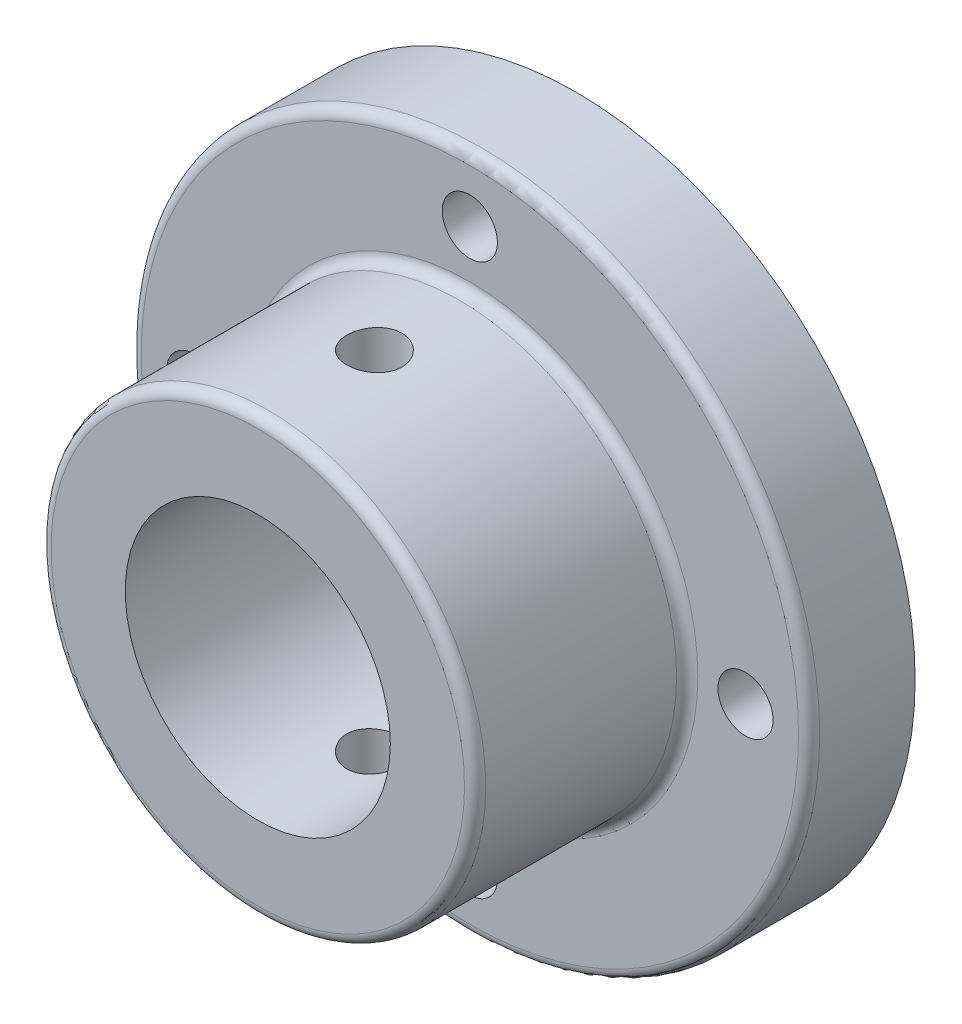
ISO-10303-21;
HEADER;
FILE_DESCRIPTION(('STEP AP214'),'2;1');
FILE_NAME('part.step','',(''),(''),'','','');
FILE_SCHEMA(('AUTOMOTIVE_DESIGN { 1 0 10303 214 1 1 1 1 }'));
ENDSEC;
DATA;
#1=APPLICATION_CONTEXT('core data for automotive mechanical design processes');
#2=APPLICATION_PROTOCOL_DEFINITION('international standard','automotive_design',2000,#1);
#3=PRODUCT_CONTEXT('',#1,'mechanical');
#4=PRODUCT('Part','Part','',(#3));
#5=PRODUCT_RELATED_PRODUCT_CATEGORY('part','',(#4));
#6=PRODUCT_DEFINITION_FORMATION('','',#4);
#7=PRODUCT_DEFINITION_CONTEXT('part definition',#1,'design');
#8=PRODUCT_DEFINITION('design','',#6,#7);
#9=PRODUCT_DEFINITION_SHAPE('','',#8);
#10=(LENGTH_UNIT() NAMED_UNIT(*) SI_UNIT(.MILLI.,.METRE.));
#11=(NAMED_UNIT(*) PLANE_ANGLE_UNIT() SI_UNIT($,.RADIAN.));
#12=(NAMED_UNIT(*) SI_UNIT($,.STERADIAN.) SOLID_ANGLE_UNIT());
#13=UNCERTAINTY_MEASURE_WITH_UNIT(LENGTH_MEASURE(1.E-05),#10,'distance_accuracy_value','');
#14=(GEOMETRIC_REPRESENTATION_CONTEXT(3) GLOBAL_UNCERTAINTY_ASSIGNED_CONTEXT((#13)) GLOBAL_UNIT_ASSIGNED_CONTEXT((#10,
#11,#12)) REPRESENTATION_CONTEXT('',''));
#15=CARTESIAN_POINT('',(0.,0.,0.));
#16=DIRECTION('',(0.,0.,1.));
#17=DIRECTION('',(1.,0.,0.));
#18=AXIS2_PLACEMENT_3D('',#15,#16,#17);
#19=CARTESIAN_POINT('',(0.,0.,5.));
#20=DIRECTION('',(0.,0.,1.));
#21=DIRECTION('',(1.,0.,0.));
#22=AXIS2_PLACEMENT_3D('',#19,#20,#21);
#23=PLANE('',#22);
#24=CARTESIAN_POINT('',(0.,0.,5.));
#25=DIRECTION('',(0.,0.,1.));
#26=DIRECTION('',(1.,0.,0.));
#27=AXIS2_PLACEMENT_3D('',#24,#25,#26);
#28=CIRCLE('',#27,15.5);
#29=CARTESIAN_POINT('',(15.5,0.,5.));
#30=VERTEX_POINT('',#29);
#31=EDGE_CURVE('E45',#30,#30,#28,.T.);
#32=ORIENTED_EDGE('',*,*,#31,.T.);
#33=EDGE_LOOP('',(#32));
#34=FACE_BOUND('',#33,.T.);
#35=CARTESIAN_POINT('',(0.,0.,5.));
#36=DIRECTION('',(0.,0.,1.));
#37=DIRECTION('',(1.,0.,0.));
#38=AXIS2_PLACEMENT_3D('',#35,#36,#37);
#39=CIRCLE('',#38,10.75);
#40=CARTESIAN_POINT('',(10.75,0.,5.));
#41=VERTEX_POINT('',#40);
#42=EDGE_CURVE('E49',#41,#41,#39,.F.);
#43=ORIENTED_EDGE('',*,*,#42,.T.);
#44=EDGE_LOOP('',(#43));
#45=FACE_BOUND('',#44,.T.);
#46=CARTESIAN_POINT('',(-13.,0.,5.));
#47=DIRECTION('',(0.,0.,1.));
#48=DIRECTION('',(1.,0.,0.));
#49=AXIS2_PLACEMENT_3D('',#46,#47,#48);
#50=CIRCLE('',#49,1.3);
#51=CARTESIAN_POINT('',(-11.7,0.,5.));
#52=VERTEX_POINT('',#51);
#53=EDGE_CURVE('E147',#52,#52,#50,.T.);
#54=ORIENTED_EDGE('',*,*,#53,.F.);
#55=EDGE_LOOP('',(#54));
#56=FACE_BOUND('',#55,.T.);
#57=CARTESIAN_POINT('',(13.,0.,5.));
#58=DIRECTION('',(0.,0.,1.));
#59=DIRECTION('',(1.,0.,0.));
#60=AXIS2_PLACEMENT_3D('',#57,#58,#59);
#61=CIRCLE('',#60,1.30000000000004);
#62=CARTESIAN_POINT('',(14.3,0.,5.));
#63=VERTEX_POINT('',#62);
#64=EDGE_CURVE('E151',#63,#63,#61,.T.);
#65=ORIENTED_EDGE('',*,*,#64,.F.);
#66=EDGE_LOOP('',(#65));
#67=FACE_BOUND('',#66,.T.);
#68=CARTESIAN_POINT('',(0.,13.,5.));
#69=DIRECTION('',(0.,0.,1.));
#70=DIRECTION('',(1.,0.,0.));
#71=AXIS2_PLACEMENT_3D('',#68,#69,#70);
#72=CIRCLE('',#71,1.3);
#73=CARTESIAN_POINT('',(1.3,13.,5.));
#74=VERTEX_POINT('',#73);
#75=EDGE_CURVE('E155',#74,#74,#72,.T.);
#76=ORIENTED_EDGE('',*,*,#75,.F.);
#77=EDGE_LOOP('',(#76));
#78=FACE_BOUND('',#77,.T.);
#79=CARTESIAN_POINT('',(0.,-13.,5.));
#80=DIRECTION('',(0.,0.,1.));
#81=DIRECTION('',(1.,0.,0.));
#82=AXIS2_PLACEMENT_3D('',#79,#80,#81);
#83=CIRCLE('',#82,1.3);
#84=CARTESIAN_POINT('',(1.3,-13.,5.));
#85=VERTEX_POINT('',#84);
#86=EDGE_CURVE('E158',#85,#85,#83,.T.);
#87=ORIENTED_EDGE('',*,*,#86,.F.);
#88=EDGE_LOOP('',(#87));
#89=FACE_BOUND('',#88,.T.);
#90=ADVANCED_FACE('F38',(#34,#45,#56,#67,#78,#89),#23,.T.);
#91=CARTESIAN_POINT('',(0.,0.,0.));
#92=DIRECTION('',(0.,0.,1.));
#93=DIRECTION('',(1.,0.,0.));
#94=AXIS2_PLACEMENT_3D('',#91,#92,#93);
#95=PLANE('',#94);
#96=CARTESIAN_POINT('',(0.,0.,0.));
#97=DIRECTION('',(0.,0.,1.));
#98=DIRECTION('',(1.,0.,0.));
#99=AXIS2_PLACEMENT_3D('',#96,#97,#98);
#100=CIRCLE('',#99,6.25);
#101=CARTESIAN_POINT('',(6.25,0.,0.));
#102=VERTEX_POINT('',#101);
#103=EDGE_CURVE('E171',#102,#102,#100,.T.);
#104=ORIENTED_EDGE('',*,*,#103,.T.);
#105=EDGE_LOOP('',(#104));
#106=FACE_BOUND('',#105,.T.);
#107=CARTESIAN_POINT('',(-13.,0.,0.));
#108=DIRECTION('',(0.,0.,1.));
#109=DIRECTION('',(1.,0.,0.));
#110=AXIS2_PLACEMENT_3D('',#107,#108,#109);
#111=CIRCLE('',#110,1.3);
#112=CARTESIAN_POINT('',(-11.7,0.,0.));
#113=VERTEX_POINT('',#112);
#114=EDGE_CURVE('E168',#113,#113,#111,.T.);
#115=ORIENTED_EDGE('',*,*,#114,.T.);
#116=EDGE_LOOP('',(#115));
#117=FACE_BOUND('',#116,.T.);
#118=CARTESIAN_POINT('',(0.,-13.,0.));
#119=DIRECTION('',(0.,0.,1.));
#120=DIRECTION('',(1.,0.,0.));
#121=AXIS2_PLACEMENT_3D('',#118,#119,#120);
#122=CIRCLE('',#121,1.3);
#123=CARTESIAN_POINT('',(1.3,-13.,0.));
#124=VERTEX_POINT('',#123);
#125=EDGE_CURVE('E161',#124,#124,#122,.T.);
#126=ORIENTED_EDGE('',*,*,#125,.T.);
#127=EDGE_LOOP('',(#126));
#128=FACE_BOUND('',#127,.T.);
#129=CARTESIAN_POINT('',(13.,0.,0.));
#130=DIRECTION('',(0.,0.,1.));
#131=DIRECTION('',(1.,0.,0.));
#132=AXIS2_PLACEMENT_3D('',#129,#130,#131);
#133=CIRCLE('',#132,1.30000000000004);
#134=CARTESIAN_POINT('',(14.3,0.,0.));
#135=VERTEX_POINT('',#134);
#136=EDGE_CURVE('E160',#135,#135,#133,.T.);
#137=ORIENTED_EDGE('',*,*,#136,.T.);
#138=EDGE_LOOP('',(#137));
#139=FACE_BOUND('',#138,.T.);
#140=CARTESIAN_POINT('',(0.,13.,0.));
#141=DIRECTION('',(0.,0.,1.));
#142=DIRECTION('',(1.,0.,0.));
#143=AXIS2_PLACEMENT_3D('',#140,#141,#142);
#144=CIRCLE('',#143,1.3);
#145=CARTESIAN_POINT('',(1.3,13.,0.));
#146=VERTEX_POINT('',#145);
#147=EDGE_CURVE('E175',#146,#146,#144,.T.);
#148=ORIENTED_EDGE('',*,*,#147,.T.);
#149=EDGE_LOOP('',(#148));
#150=FACE_BOUND('',#149,.T.);
#151=CARTESIAN_POINT('',(0.,0.,0.));
#152=DIRECTION('',(0.,0.,1.));
#153=DIRECTION('',(1.,0.,0.));
#154=AXIS2_PLACEMENT_3D('',#151,#152,#153);
#155=CIRCLE('',#154,16.);
#156=CARTESIAN_POINT('',(16.,0.,0.));
#157=VERTEX_POINT('',#156);
#158=EDGE_CURVE('E64',#157,#157,#155,.T.);
#159=ORIENTED_EDGE('',*,*,#158,.F.);
#160=EDGE_LOOP('',(#159));
#161=FACE_BOUND('',#160,.T.);
#162=ADVANCED_FACE('F121',(#106,#117,#128,#139,#150,#161),#95,.F.);
#163=CARTESIAN_POINT('',(0.,0.,5.));
#164=DIRECTION('',(0.,0.,-1.));
#165=DIRECTION('',(-1.,0.,0.));
#166=AXIS2_PLACEMENT_3D('',#163,#164,#165);
#167=CYLINDRICAL_SURFACE('',#166,16.);
#168=CARTESIAN_POINT('',(0.,0.,4.5));
#169=DIRECTION('',(0.,0.,1.));
#170=DIRECTION('',(1.,0.,0.));
#171=AXIS2_PLACEMENT_3D('',#168,#169,#170);
#172=CIRCLE('',#171,16.);
#173=CARTESIAN_POINT('',(16.,0.,4.5));
#174=VERTEX_POINT('',#173);
#175=EDGE_CURVE('E10',#174,#174,#172,.F.);
#176=ORIENTED_EDGE('',*,*,#175,.T.);
#177=EDGE_LOOP('',(#176));
#178=FACE_BOUND('',#177,.T.);
#179=ORIENTED_EDGE('',*,*,#158,.T.);
#180=EDGE_LOOP('',(#179));
#181=FACE_BOUND('',#180,.T.);
#182=ADVANCED_FACE('F117',(#178,#181),#167,.T.);
#183=CARTESIAN_POINT('',(0.,13.,5.));
#184=DIRECTION('',(0.,0.,-1.));
#185=DIRECTION('',(-1.,0.,0.));
#186=AXIS2_PLACEMENT_3D('',#183,#184,#185);
#187=CYLINDRICAL_SURFACE('',#186,1.3);
#188=ORIENTED_EDGE('',*,*,#75,.T.);
#189=EDGE_LOOP('',(#188));
#190=FACE_BOUND('',#189,.T.);
#191=ORIENTED_EDGE('',*,*,#147,.F.);
#192=EDGE_LOOP('',(#191));
#193=FACE_BOUND('',#192,.T.);
#194=ADVANCED_FACE('F111',(#190,#193),#187,.F.);
#195=CARTESIAN_POINT('',(0.,0.,5.));
#196=DIRECTION('',(0.,0.,-1.));
#197=DIRECTION('',(-1.,0.,0.));
#198=AXIS2_PLACEMENT_3D('',#195,#196,#197);
#199=CYLINDRICAL_SURFACE('',#198,6.25);
#200=CARTESIAN_POINT('',(0.,-6.25,10.8));
#201=CARTESIAN_POINT('',(0.0721880338353734,-6.24999866390579,10.7999974200107));
#202=CARTESIAN_POINT('',(0.144408070056718,-6.248736549544,10.7939668677071));
#203=CARTESIAN_POINT('',(0.286802595986332,-6.24382353153826,10.7700255993797));
#204=CARTESIAN_POINT('',(0.356975486251104,-6.24017080969524,10.7521058407652));
#205=CARTESIAN_POINT('',(0.493196719612505,-6.23088396610351,10.7049670574396));
#206=CARTESIAN_POINT('',(0.559249087752339,-6.22525181476898,10.6757592664789));
#207=CARTESIAN_POINT('',(0.685512240017916,-6.21261654104479,10.6069078657945));
#208=CARTESIAN_POINT('',(0.745723289159936,-6.20561348089579,10.567264729818));
#209=CARTESIAN_POINT('',(0.859476728423463,-6.19089141284008,10.4780552394111));
#210=CARTESIAN_POINT('',(0.912921647148352,-6.18316424208161,10.4283659320048));
#211=CARTESIAN_POINT('',(1.01078123233217,-6.16792345232901,10.320738762281));
#212=CARTESIAN_POINT('',(1.05519515318748,-6.16040985101129,10.2628002195736));
#213=CARTESIAN_POINT('',(1.13415320164102,-6.14636690210939,10.1396099487518));
#214=CARTESIAN_POINT('',(1.16859521736711,-6.13984804009531,10.0742914711776));
#215=CARTESIAN_POINT('',(1.22597726554449,-6.12864912260314,9.93863627768076));
#216=CARTESIAN_POINT('',(1.2489185329687,-6.12396886970328,9.86830010149543));
#217=CARTESIAN_POINT('',(1.28232904723058,-6.1170599131927,9.72565846400949));
#218=CARTESIAN_POINT('',(1.29296996913948,-6.11479749857398,9.65339488044609));
#219=CARTESIAN_POINT('',(1.30201121205367,-6.1128790055134,9.50807545588087));
#220=CARTESIAN_POINT('',(1.30041288938945,-6.11322263827414,9.43501970356171));
#221=CARTESIAN_POINT('',(1.28515954443023,-6.11644682995733,9.29145411758323));
#222=CARTESIAN_POINT('',(1.27170241119847,-6.11928574783139,9.22092218331584));
#223=CARTESIAN_POINT('',(1.23342628546527,-6.12711495696342,9.08313944783501));
#224=CARTESIAN_POINT('',(1.20860671060089,-6.13210535849133,9.0158888149947));
#225=CARTESIAN_POINT('',(1.14812432035159,-6.14371717305132,8.88601322735296));
#226=CARTESIAN_POINT('',(1.11238404976515,-6.15035017035826,8.82342542174911));
#227=CARTESIAN_POINT('',(1.0311293731486,-6.16449250858458,8.70506168122288));
#228=CARTESIAN_POINT('',(0.985613756257515,-6.1720019580164,8.64928659152771));
#229=CARTESIAN_POINT('',(0.885045881312846,-6.18723075501508,8.54499071433922));
#230=CARTESIAN_POINT('',(0.82982498317985,-6.19495134031028,8.49663257343026));
#231=CARTESIAN_POINT('',(0.711971888840538,-6.20959872838224,8.40983872950592));
#232=CARTESIAN_POINT('',(0.649339582135517,-6.21652551932107,8.37140317445625));
#233=CARTESIAN_POINT('',(0.518253473087785,-6.22882407206186,8.30551127586901));
#234=CARTESIAN_POINT('',(0.449789476871738,-6.23419303548394,8.27807465678755));
#235=CARTESIAN_POINT('',(0.309087001034974,-6.24274995924435,8.23513896482847));
#236=CARTESIAN_POINT('',(0.23684901803574,-6.24593820577048,8.21963832549114));
#237=CARTESIAN_POINT('',(0.0920457528536136,-6.24973424384651,8.20124748987132));
#238=CARTESIAN_POINT('',(0.0195098755956257,-6.25038754182249,8.19813488188971));
#239=CARTESIAN_POINT('',(-0.125045418306469,-6.24916694021021,8.20400787620958));
#240=CARTESIAN_POINT('',(-0.197064866198393,-6.24729319484641,8.21299274020709));
#241=CARTESIAN_POINT('',(-0.337817325850833,-6.24125761947136,8.2426209838981));
#242=CARTESIAN_POINT('',(-0.406575637752775,-6.23711840481734,8.26314918526294));
#243=CARTESIAN_POINT('',(-0.539673755273383,-6.22701462109886,8.31515469705965));
#244=CARTESIAN_POINT('',(-0.604013209758812,-6.22104990718076,8.346632876401));
#245=CARTESIAN_POINT('',(-0.727377635599887,-6.20784381614938,8.42011852687017));
#246=CARTESIAN_POINT('',(-0.786321930089917,-6.20058673581721,8.46225855171283));
#247=CARTESIAN_POINT('',(-0.896382331521051,-6.18563570569592,8.55569544270983));
#248=CARTESIAN_POINT('',(-0.947497524287405,-6.17794170503283,8.60699337668663));
#249=CARTESIAN_POINT('',(-1.04131592743373,-6.16282901000841,8.71830591815483));
#250=CARTESIAN_POINT('',(-1.08386588060247,-6.15541698138264,8.77845076258095));
#251=CARTESIAN_POINT('',(-1.15826046642995,-6.14185383160522,8.90516424661616));
#252=CARTESIAN_POINT('',(-1.19010554416129,-6.13570265803561,8.97173261900848));
#253=CARTESIAN_POINT('',(-1.24198269871991,-6.1254125745716,9.10905742203129));
#254=CARTESIAN_POINT('',(-1.26207844574187,-6.12126284064039,9.17978894966189));
#255=CARTESIAN_POINT('',(-1.29007706095406,-6.1154238958216,9.32372110066989));
#256=CARTESIAN_POINT('',(-1.29798166697235,-6.11373433424223,9.39692137061148));
#257=CARTESIAN_POINT('',(-1.30130523531929,-6.11302760991146,9.54217176759453));
#258=CARTESIAN_POINT('',(-1.2969666953716,-6.11395854259959,9.6142162012991));
#259=CARTESIAN_POINT('',(-1.27646521212062,-6.11827135350504,9.75652389298057));
#260=CARTESIAN_POINT('',(-1.26030238153447,-6.12165320835849,9.82678716793009));
#261=CARTESIAN_POINT('',(-1.21672310499825,-6.13046272190421,9.96336773763464));
#262=CARTESIAN_POINT('',(-1.18933871800655,-6.13588454900163,10.0296956623558));
#263=CARTESIAN_POINT('',(-1.12412249003985,-6.148165973683,10.1568527939223));
#264=CARTESIAN_POINT('',(-1.08628968296101,-6.15502570420727,10.2176814915959));
#265=CARTESIAN_POINT('',(-1.00043227917348,-6.16956726619989,10.333315981511));
#266=CARTESIAN_POINT('',(-0.952233504416382,-6.17726186677732,10.3879908668099));
#267=CARTESIAN_POINT('',(-0.847369269056516,-6.19251702595659,10.4885564568452));
#268=CARTESIAN_POINT('',(-0.790701862052599,-6.20007755329545,10.534445136645));
#269=CARTESIAN_POINT('',(-0.669725545314441,-6.21431539131551,10.6166365677786));
#270=CARTESIAN_POINT('',(-0.605336327445581,-6.22098155761226,10.65282313786));
#271=CARTESIAN_POINT('',(-0.471267712779137,-6.23256909161379,10.7138039459849));
#272=CARTESIAN_POINT('',(-0.401593009675097,-6.2374919858819,10.7386081570902));
#273=CARTESIAN_POINT('',(-0.276497329212863,-6.24411422201492,10.771474981645));
#274=CARTESIAN_POINT('',(-0.221774370149252,-6.24630816087785,10.7821522427664));
#275=CARTESIAN_POINT('',(-0.111373934148548,-6.24925153876851,10.7964156169889));
#276=CARTESIAN_POINT('',(-0.0556964923515547,-6.25000103086006,10.8000019905841));
#277=CARTESIAN_POINT('',(0.,-6.25,10.8));
#278=B_SPLINE_CURVE_WITH_KNOTS('',3,(#200,#201,#202,#203,#204,#205,#206,#207,#208,#209,#210,
#211,#212,#213,#214,#215,#216,#217,#218,#219,#220,#221,#222,#223,#224,#225,#226,#227,#228,#229,
#230,#231,#232,#233,#234,#235,#236,#237,#238,#239,#240,#241,#242,#243,#244,#245,#246,#247,#248,
#249,#250,#251,#252,#253,#254,#255,#256,#257,#258,#259,#260,#261,#262,#263,#264,#265,#266,#267,
#268,#269,#270,#271,#272,#273,#274,#275,#276,#277),.UNSPECIFIED.,.T.,.F.,(4,2,2,2,2,2,2,2,2,2,2,
2,2,2,2,2,2,2,2,2,2,2,2,2,2,2,2,2,2,2,2,2,2,2,2,2,2,2,4),(0.,0.216360298983076,
0.432885344360352,0.649195458509514,0.865495754236463,1.08462378961128,1.30376990896522,
1.52508655164527,1.74637942381659,1.96454494477804,2.18268628938905,2.39725499244209,
2.61183469408658,2.82797309295077,3.04413828008844,3.26451821185541,3.48490142974078,
3.7056781129375,3.92642581679977,4.14319189409036,4.35994474283178,4.57457227869739,
4.78921684970762,5.0066737503725,5.2241560233358,5.44523845280194,5.66631168926935,
5.88617554110981,6.10600804880455,6.32151711059194,6.53702411802803,6.75191968718101,
6.96683513311755,7.18569178421746,7.40459881415434,7.62602068892801,7.84724818480795,
8.01418655138469,8.18111878512543),.UNSPECIFIED.);
#279=CARTESIAN_POINT('',(0.,-6.25,10.8));
#280=VERTEX_POINT('',#279);
#281=EDGE_CURVE('E100',#280,#280,#278,.T.);
#282=ORIENTED_EDGE('',*,*,#281,.F.);
#283=EDGE_LOOP('',(#282));
#284=FACE_BOUND('',#283,.T.);
#285=CARTESIAN_POINT('',(0.,6.25,10.8));
#286=CARTESIAN_POINT('',(-0.0721880338353734,6.24999866390579,10.7999974200107));
#287=CARTESIAN_POINT('',(-0.144408070056718,6.248736549544,10.7939668677071));
#288=CARTESIAN_POINT('',(-0.286802595986332,6.24382353153826,10.7700255993797));
#289=CARTESIAN_POINT('',(-0.356975486251104,6.24017080969524,10.7521058407652));
#290=CARTESIAN_POINT('',(-0.493196719612505,6.23088396610351,10.7049670574396));
#291=CARTESIAN_POINT('',(-0.559249087752339,6.22525181476898,10.6757592664789));
#292=CARTESIAN_POINT('',(-0.685512240017916,6.21261654104479,10.6069078657945));
#293=CARTESIAN_POINT('',(-0.745723289159936,6.20561348089579,10.567264729818));
#294=CARTESIAN_POINT('',(-0.859476728423463,6.19089141284008,10.4780552394111));
#295=CARTESIAN_POINT('',(-0.912921647148352,6.18316424208161,10.4283659320048));
#296=CARTESIAN_POINT('',(-1.01078123233217,6.16792345232901,10.320738762281));
#297=CARTESIAN_POINT('',(-1.05519515318748,6.16040985101129,10.2628002195736));
#298=CARTESIAN_POINT('',(-1.13415320164102,6.14636690210939,10.1396099487518));
#299=CARTESIAN_POINT('',(-1.16859521736711,6.13984804009531,10.0742914711776));
#300=CARTESIAN_POINT('',(-1.22597726554449,6.12864912260314,9.93863627768076));
#301=CARTESIAN_POINT('',(-1.2489185329687,6.12396886970328,9.86830010149543));
#302=CARTESIAN_POINT('',(-1.28232904723058,6.1170599131927,9.72565846400949));
#303=CARTESIAN_POINT('',(-1.29296996913948,6.11479749857398,9.65339488044609));
#304=CARTESIAN_POINT('',(-1.30201121205367,6.1128790055134,9.50807545588087));
#305=CARTESIAN_POINT('',(-1.30041288938945,6.11322263827414,9.43501970356171));
#306=CARTESIAN_POINT('',(-1.28515954443023,6.11644682995733,9.29145411758323));
#307=CARTESIAN_POINT('',(-1.27170241119847,6.11928574783139,9.22092218331584));
#308=CARTESIAN_POINT('',(-1.23342628546527,6.12711495696342,9.08313944783501));
#309=CARTESIAN_POINT('',(-1.20860671060089,6.13210535849133,9.0158888149947));
#310=CARTESIAN_POINT('',(-1.14812432035159,6.14371717305132,8.88601322735296));
#311=CARTESIAN_POINT('',(-1.11238404976515,6.15035017035826,8.82342542174911));
#312=CARTESIAN_POINT('',(-1.0311293731486,6.16449250858458,8.70506168122288));
#313=CARTESIAN_POINT('',(-0.985613756257515,6.1720019580164,8.64928659152771));
#314=CARTESIAN_POINT('',(-0.885045881312846,6.18723075501508,8.54499071433922));
#315=CARTESIAN_POINT('',(-0.82982498317985,6.19495134031028,8.49663257343026));
#316=CARTESIAN_POINT('',(-0.711971888840538,6.20959872838224,8.40983872950592));
#317=CARTESIAN_POINT('',(-0.649339582135517,6.21652551932107,8.37140317445625));
#318=CARTESIAN_POINT('',(-0.518253473087785,6.22882407206186,8.30551127586901));
#319=CARTESIAN_POINT('',(-0.449789476871738,6.23419303548394,8.27807465678755));
#320=CARTESIAN_POINT('',(-0.309087001034974,6.24274995924435,8.23513896482847));
#321=CARTESIAN_POINT('',(-0.23684901803574,6.24593820577048,8.21963832549114));
#322=CARTESIAN_POINT('',(-0.0920457528536136,6.24973424384651,8.20124748987132));
#323=CARTESIAN_POINT('',(-0.0195098755956257,6.25038754182249,8.19813488188971));
#324=CARTESIAN_POINT('',(0.125045418306469,6.24916694021021,8.20400787620958));
#325=CARTESIAN_POINT('',(0.197064866198393,6.24729319484641,8.21299274020709));
#326=CARTESIAN_POINT('',(0.337817325850833,6.24125761947136,8.2426209838981));
#327=CARTESIAN_POINT('',(0.406575637752775,6.23711840481734,8.26314918526294));
#328=CARTESIAN_POINT('',(0.539673755273383,6.22701462109886,8.31515469705965));
#329=CARTESIAN_POINT('',(0.604013209758812,6.22104990718076,8.346632876401));
#330=CARTESIAN_POINT('',(0.727377635599887,6.20784381614938,8.42011852687017));
#331=CARTESIAN_POINT('',(0.786321930089917,6.20058673581721,8.46225855171283));
#332=CARTESIAN_POINT('',(0.896382331521051,6.18563570569592,8.55569544270983));
#333=CARTESIAN_POINT('',(0.947497524287405,6.17794170503283,8.60699337668663));
#334=CARTESIAN_POINT('',(1.04131592743373,6.16282901000841,8.71830591815483));
#335=CARTESIAN_POINT('',(1.08386588060247,6.15541698138264,8.77845076258095));
#336=CARTESIAN_POINT('',(1.15826046642995,6.14185383160522,8.90516424661616));
#337=CARTESIAN_POINT('',(1.19010554416129,6.13570265803561,8.97173261900848));
#338=CARTESIAN_POINT('',(1.24198269871991,6.1254125745716,9.10905742203129));
#339=CARTESIAN_POINT('',(1.26207844574187,6.12126284064039,9.17978894966189));
#340=CARTESIAN_POINT('',(1.29007706095406,6.1154238958216,9.32372110066989));
#341=CARTESIAN_POINT('',(1.29798166697235,6.11373433424223,9.39692137061148));
#342=CARTESIAN_POINT('',(1.30130523531929,6.11302760991146,9.54217176759453));
#343=CARTESIAN_POINT('',(1.2969666953716,6.11395854259959,9.6142162012991));
#344=CARTESIAN_POINT('',(1.27646521212062,6.11827135350504,9.75652389298057));
#345=CARTESIAN_POINT('',(1.26030238153447,6.12165320835849,9.82678716793009));
#346=CARTESIAN_POINT('',(1.21672310499825,6.13046272190421,9.96336773763464));
#347=CARTESIAN_POINT('',(1.18933871800655,6.13588454900163,10.0296956623558));
#348=CARTESIAN_POINT('',(1.12412249003985,6.148165973683,10.1568527939223));
#349=CARTESIAN_POINT('',(1.08628968296101,6.15502570420727,10.2176814915959));
#350=CARTESIAN_POINT('',(1.00043227917348,6.16956726619989,10.333315981511));
#351=CARTESIAN_POINT('',(0.952233504416382,6.17726186677732,10.3879908668099));
#352=CARTESIAN_POINT('',(0.847369269056516,6.19251702595659,10.4885564568452));
#353=CARTESIAN_POINT('',(0.790701862052599,6.20007755329545,10.534445136645));
#354=CARTESIAN_POINT('',(0.669725545314441,6.21431539131551,10.6166365677786));
#355=CARTESIAN_POINT('',(0.605336327445581,6.22098155761226,10.65282313786));
#356=CARTESIAN_POINT('',(0.471267712779137,6.23256909161379,10.7138039459849));
#357=CARTESIAN_POINT('',(0.401593009675097,6.2374919858819,10.7386081570902));
#358=CARTESIAN_POINT('',(0.276497329212863,6.24411422201492,10.771474981645));
#359=CARTESIAN_POINT('',(0.221774370149252,6.24630816087785,10.7821522427664));
#360=CARTESIAN_POINT('',(0.111373934148548,6.24925153876851,10.7964156169889));
#361=CARTESIAN_POINT('',(0.0556964923515547,6.25000103086006,10.8000019905841));
#362=CARTESIAN_POINT('',(0.,6.25,10.8));
#363=B_SPLINE_CURVE_WITH_KNOTS('',3,(#285,#286,#287,#288,#289,#290,#291,#292,#293,#294,#295,
#296,#297,#298,#299,#300,#301,#302,#303,#304,#305,#306,#307,#308,#309,#310,#311,#312,#313,#314,
#315,#316,#317,#318,#319,#320,#321,#322,#323,#324,#325,#326,#327,#328,#329,#330,#331,#332,#333,
#334,#335,#336,#337,#338,#339,#340,#341,#342,#343,#344,#345,#346,#347,#348,#349,#350,#351,#352,
#353,#354,#355,#356,#357,#358,#359,#360,#361,#362),.UNSPECIFIED.,.T.,.F.,(4,2,2,2,2,2,2,2,2,2,2,
2,2,2,2,2,2,2,2,2,2,2,2,2,2,2,2,2,2,2,2,2,2,2,2,2,2,2,4),(0.,0.216360298983076,
0.432885344360352,0.649195458509514,0.865495754236463,1.08462378961128,1.30376990896522,
1.52508655164527,1.74637942381659,1.96454494477804,2.18268628938905,2.39725499244209,
2.61183469408658,2.82797309295077,3.04413828008844,3.26451821185541,3.48490142974078,
3.7056781129375,3.92642581679977,4.14319189409036,4.35994474283178,4.57457227869739,
4.78921684970762,5.0066737503725,5.2241560233358,5.44523845280194,5.66631168926935,
5.88617554110981,6.10600804880455,6.32151711059194,6.53702411802803,6.75191968718101,
6.96683513311755,7.18569178421746,7.40459881415434,7.62602068892801,7.84724818480795,
8.01418655138469,8.18111878512543),.UNSPECIFIED.);
#364=CARTESIAN_POINT('',(0.,6.25,10.8));
#365=VERTEX_POINT('',#364);
#366=EDGE_CURVE('E73',#365,#365,#363,.T.);
#367=ORIENTED_EDGE('',*,*,#366,.F.);
#368=EDGE_LOOP('',(#367));
#369=FACE_BOUND('',#368,.T.);
#370=ORIENTED_EDGE('',*,*,#103,.F.);
#371=EDGE_LOOP('',(#370));
#372=FACE_BOUND('',#371,.T.);
#373=CARTESIAN_POINT('',(0.,0.,15.));
#374=DIRECTION('',(0.,0.,1.));
#375=DIRECTION('',(1.,0.,0.));
#376=AXIS2_PLACEMENT_3D('',#373,#374,#375);
#377=CIRCLE('',#376,6.25);
#378=CARTESIAN_POINT('',(6.25,0.,15.));
#379=VERTEX_POINT('',#378);
#380=EDGE_CURVE('E191',#379,#379,#377,.T.);
#381=ORIENTED_EDGE('',*,*,#380,.T.);
#382=EDGE_LOOP('',(#381));
#383=FACE_BOUND('',#382,.T.);
#384=ADVANCED_FACE('F105',(#284,#369,#372,#383),#199,.F.);
#385=CARTESIAN_POINT('',(13.,0.,5.));
#386=DIRECTION('',(0.,0.,-1.));
#387=DIRECTION('',(-1.,0.,0.));
#388=AXIS2_PLACEMENT_3D('',#385,#386,#387);
#389=CYLINDRICAL_SURFACE('',#388,1.30000000000004);
#390=ORIENTED_EDGE('',*,*,#64,.T.);
#391=EDGE_LOOP('',(#390));
#392=FACE_BOUND('',#391,.T.);
#393=ORIENTED_EDGE('',*,*,#136,.F.);
#394=EDGE_LOOP('',(#393));
#395=FACE_BOUND('',#394,.T.);
#396=ADVANCED_FACE('F110',(#392,#395),#389,.F.);
#397=CARTESIAN_POINT('',(0.,-13.,5.));
#398=DIRECTION('',(0.,0.,-1.));
#399=DIRECTION('',(-1.,0.,0.));
#400=AXIS2_PLACEMENT_3D('',#397,#398,#399);
#401=CYLINDRICAL_SURFACE('',#400,1.3);
#402=ORIENTED_EDGE('',*,*,#86,.T.);
#403=EDGE_LOOP('',(#402));
#404=FACE_BOUND('',#403,.T.);
#405=ORIENTED_EDGE('',*,*,#125,.F.);
#406=EDGE_LOOP('',(#405));
#407=FACE_BOUND('',#406,.T.);
#408=ADVANCED_FACE('F199',(#404,#407),#401,.F.);
#409=CARTESIAN_POINT('',(-13.,0.,5.));
#410=DIRECTION('',(0.,0.,-1.));
#411=DIRECTION('',(-1.,0.,0.));
#412=AXIS2_PLACEMENT_3D('',#409,#410,#411);
#413=CYLINDRICAL_SURFACE('',#412,1.3);
#414=ORIENTED_EDGE('',*,*,#53,.T.);
#415=EDGE_LOOP('',(#414));
#416=FACE_BOUND('',#415,.T.);
#417=ORIENTED_EDGE('',*,*,#114,.F.);
#418=EDGE_LOOP('',(#417));
#419=FACE_BOUND('',#418,.T.);
#420=ADVANCED_FACE('F196',(#416,#419),#413,.F.);
#421=CARTESIAN_POINT('',(0.,0.,15.));
#422=DIRECTION('',(0.,0.,1.));
#423=DIRECTION('',(1.,0.,0.));
#424=AXIS2_PLACEMENT_3D('',#421,#422,#423);
#425=PLANE('',#424);
#426=CARTESIAN_POINT('',(0.,0.,15.));
#427=DIRECTION('',(0.,0.,1.));
#428=DIRECTION('',(1.,0.,0.));
#429=AXIS2_PLACEMENT_3D('',#426,#427,#428);
#430=CIRCLE('',#429,9.75);
#431=CARTESIAN_POINT('',(9.75,0.,15.));
#432=VERTEX_POINT('',#431);
#433=EDGE_CURVE('E61',#432,#432,#430,.T.);
#434=ORIENTED_EDGE('',*,*,#433,.T.);
#435=EDGE_LOOP('',(#434));
#436=FACE_BOUND('',#435,.T.);
#437=ORIENTED_EDGE('',*,*,#380,.F.);
#438=EDGE_LOOP('',(#437));
#439=FACE_BOUND('',#438,.T.);
#440=ADVANCED_FACE('F89',(#436,#439),#425,.T.);
#441=CARTESIAN_POINT('',(0.,0.,15.));
#442=DIRECTION('',(0.,0.,-1.));
#443=DIRECTION('',(-1.,0.,0.));
#444=AXIS2_PLACEMENT_3D('',#441,#442,#443);
#445=CYLINDRICAL_SURFACE('',#444,10.25);
#446=CARTESIAN_POINT('',(0.,0.,14.5));
#447=DIRECTION('',(0.,0.,1.));
#448=DIRECTION('',(1.,0.,0.));
#449=AXIS2_PLACEMENT_3D('',#446,#447,#448);
#450=CIRCLE('',#449,10.25);
#451=CARTESIAN_POINT('',(10.25,0.,14.5));
#452=VERTEX_POINT('',#451);
#453=EDGE_CURVE('E53',#452,#452,#450,.F.);
#454=ORIENTED_EDGE('',*,*,#453,.T.);
#455=EDGE_LOOP('',(#454));
#456=FACE_BOUND('',#455,.T.);
#457=CARTESIAN_POINT('',(0.,0.,5.5));
#458=DIRECTION('',(0.,0.,1.));
#459=DIRECTION('',(1.,0.,0.));
#460=AXIS2_PLACEMENT_3D('',#457,#458,#459);
#461=CIRCLE('',#460,10.25);
#462=CARTESIAN_POINT('',(10.25,0.,5.5));
#463=VERTEX_POINT('',#462);
#464=EDGE_CURVE('E58',#463,#463,#461,.T.);
#465=ORIENTED_EDGE('',*,*,#464,.T.);
#466=EDGE_LOOP('',(#465));
#467=FACE_BOUND('',#466,.T.);
#468=CARTESIAN_POINT('',(0.,-10.25,10.8));
#469=CARTESIAN_POINT('',(0.0727084564679182,-10.249998973525,10.7999969165429));
#470=CARTESIAN_POINT('',(0.145462129942122,-10.2492181966978,10.7938796014106));
#471=CARTESIAN_POINT('',(0.28894438119896,-10.2461786282642,10.7695733433283));
#472=CARTESIAN_POINT('',(0.359670774239432,-10.2439183003993,10.7513718527664));
#473=CARTESIAN_POINT('',(0.497000541671225,-10.2381742259312,10.7034426537496));
#474=CARTESIAN_POINT('',(0.563606678844364,-10.2346913098106,10.6737227681132));
#475=CARTESIAN_POINT('',(0.690873512655458,-10.2268892607925,10.603617665132));
#476=CARTESIAN_POINT('',(0.751535213652993,-10.2225702695249,10.563234253749));
#477=CARTESIAN_POINT('',(0.865547078444222,-10.2135508154279,10.4727041028589));
#478=CARTESIAN_POINT('',(0.918858741618123,-10.2088485350191,10.4225090526139));
#479=CARTESIAN_POINT('',(1.01632559023619,-10.1996071049203,10.3138842213241));
#480=CARTESIAN_POINT('',(1.06048030517167,-10.1950679636228,10.2554540173939));
#481=CARTESIAN_POINT('',(1.13852372141468,-10.1866488764755,10.1317667120736));
#482=CARTESIAN_POINT('',(1.1723762698649,-10.182771272567,10.0664866260388));
#483=CARTESIAN_POINT('',(1.22862351086166,-10.1761383264167,9.93111051358846));
#484=CARTESIAN_POINT('',(1.25101865046493,-10.1733829403879,9.86101467519981));
#485=CARTESIAN_POINT('',(1.28359818628535,-10.1693237985982,9.7183967908178));
#486=CARTESIAN_POINT('',(1.29384765613884,-10.168012309487,9.64588983415703));
#487=CARTESIAN_POINT('',(1.30204628309213,-10.1669657988854,9.50017404330149));
#488=CARTESIAN_POINT('',(1.29999594893672,-10.1672307121918,9.42696523826164));
#489=CARTESIAN_POINT('',(1.28370657102133,-10.1692999977015,9.28237780354506));
#490=CARTESIAN_POINT('',(1.26953926182317,-10.1710953094776,9.21099094405911));
#491=CARTESIAN_POINT('',(1.22953003984763,-10.1760089718098,9.07161611935681));
#492=CARTESIAN_POINT('',(1.20368788416349,-10.1791273498936,9.00362822489199));
#493=CARTESIAN_POINT('',(1.14098559782978,-10.186346036263,8.87275871607469));
#494=CARTESIAN_POINT('',(1.10409434752638,-10.1904491113638,8.80989217063426));
#495=CARTESIAN_POINT('',(1.02036333467442,-10.1991727478114,8.69121505248429));
#496=CARTESIAN_POINT('',(0.973523103738967,-10.2037933335173,8.63540481217515));
#497=CARTESIAN_POINT('',(0.870826451181914,-10.2130716257177,8.53200822342182));
#498=CARTESIAN_POINT('',(0.814908208526152,-10.2177293622735,8.4844832586718));
#499=CARTESIAN_POINT('',(0.695855558723031,-10.2265263796642,8.39948440708385));
#500=CARTESIAN_POINT('',(0.632721134089889,-10.2306656592429,8.36201054460182));
#501=CARTESIAN_POINT('',(0.500980542734451,-10.2379620550144,8.29817738850484));
#502=CARTESIAN_POINT('',(0.432372464368435,-10.2411188261684,8.2718219983402));
#503=CARTESIAN_POINT('',(0.291655643445553,-10.2460914109582,8.23102296058748));
#504=CARTESIAN_POINT('',(0.219547069815283,-10.2479072892343,8.21657873879514));
#505=CARTESIAN_POINT('',(0.0744068439437465,-10.2499850745816,8.2000917530237));
#506=CARTESIAN_POINT('',(0.00138494147930429,-10.2502575756661,8.19796444134853));
#507=CARTESIAN_POINT('',(-0.143974349294506,-10.2492465222577,8.20594845287338));
#508=CARTESIAN_POINT('',(-0.216311752586039,-10.2479630019025,8.21605950757542));
#509=CARTESIAN_POINT('',(-0.35799873328524,-10.2439907239143,8.24816299355858));
#510=CARTESIAN_POINT('',(-0.427357603605087,-10.2413067422334,8.27011505234969));
#511=CARTESIAN_POINT('',(-0.561409569470242,-10.2348339947029,8.32523539366495));
#512=CARTESIAN_POINT('',(-0.626102502254771,-10.2310451903373,8.35840406722619));
#513=CARTESIAN_POINT('',(-0.74936340193004,-10.2227587030539,8.43522024079062));
#514=CARTESIAN_POINT('',(-0.807897080174637,-10.2182573686135,8.4789223604006));
#515=CARTESIAN_POINT('',(-0.916828916813486,-10.2090606207459,8.57548769427519));
#516=CARTESIAN_POINT('',(-0.967226742225602,-10.2043651993851,8.62835128331462));
#517=CARTESIAN_POINT('',(-1.0587567554509,-10.1952767340008,8.74211165209798));
#518=CARTESIAN_POINT('',(-1.09983285509655,-10.1908856253555,8.80305373682124));
#519=CARTESIAN_POINT('',(-1.1711657770584,-10.182934959366,8.93102161583015));
#520=CARTESIAN_POINT('',(-1.20142282163177,-10.1793753849401,8.99804728510451));
#521=CARTESIAN_POINT('',(-1.25016820197516,-10.1735040534702,9.13609967128634));
#522=CARTESIAN_POINT('',(-1.26868801856248,-10.1711889611156,9.20711512461105));
#523=CARTESIAN_POINT('',(-1.29353453748335,-10.168059195694,9.35127919908469));
#524=CARTESIAN_POINT('',(-1.29986182514744,-10.1672444505995,9.42442771765973));
#525=CARTESIAN_POINT('',(-1.30013272446315,-10.1672097675157,9.57022343628477));
#526=CARTESIAN_POINT('',(-1.29416445668192,-10.1679784810889,9.64287048561998));
#527=CARTESIAN_POINT('',(-1.27020041704299,-10.1709996840847,9.7861199506449));
#528=CARTESIAN_POINT('',(-1.25220464508628,-10.1732521735195,9.85672236631778));
#529=CARTESIAN_POINT('',(-1.2047242321783,-10.1789835880711,9.99386595510584));
#530=CARTESIAN_POINT('',(-1.1752439664541,-10.1824620460848,10.0604086636877));
#531=CARTESIAN_POINT('',(-1.10564007052895,-10.1902542189942,10.1876169810199));
#532=CARTESIAN_POINT('',(-1.06551629144745,-10.1945679455734,10.2482825075447));
#533=CARTESIAN_POINT('',(-0.975437837804114,-10.2035816337308,10.36246467671));
#534=CARTESIAN_POINT('',(-0.925417510011365,-10.2082840454553,10.4159293358121));
#535=CARTESIAN_POINT('',(-0.817102999452936,-10.2175237053097,10.5137396187202));
#536=CARTESIAN_POINT('',(-0.758806870845801,-10.2220609142803,10.5580830918922));
#537=CARTESIAN_POINT('',(-0.635333409399524,-10.2304786080845,10.6365405601868));
#538=CARTESIAN_POINT('',(-0.570130047234856,-10.2343564541397,10.6706138553427));
#539=CARTESIAN_POINT('',(-0.434913663423788,-10.2409918257229,10.7272783770741));
#540=CARTESIAN_POINT('',(-0.364905945405967,-10.2437505641175,10.749882040911));
#541=CARTESIAN_POINT('',(-0.245449304789094,-10.2471742234137,10.7775739600086));
#542=CARTESIAN_POINT('',(-0.196752678519377,-10.2482287084757,10.785971587664));
#543=CARTESIAN_POINT('',(-0.0987109795972895,-10.2496419425656,10.7971856330125));
#544=CARTESIAN_POINT('',(-0.0493659119238824,-10.2500006969323,10.8000020935346));
#545=CARTESIAN_POINT('',(0.,-10.25,10.8));
#546=B_SPLINE_CURVE_WITH_KNOTS('',3,(#468,#469,#470,#471,#472,#473,#474,#475,#476,#477,#478,
#479,#480,#481,#482,#483,#484,#485,#486,#487,#488,#489,#490,#491,#492,#493,#494,#495,#496,#497,
#498,#499,#500,#501,#502,#503,#504,#505,#506,#507,#508,#509,#510,#511,#512,#513,#514,#515,#516,
#517,#518,#519,#520,#521,#522,#523,#524,#525,#526,#527,#528,#529,#530,#531,#532,#533,#534,#535,
#536,#537,#538,#539,#540,#541,#542,#543,#544,#545),.UNSPECIFIED.,.T.,.F.,(4,2,2,2,2,2,2,2,2,2,2,
2,2,2,2,2,2,2,2,2,2,2,2,2,2,2,2,2,2,2,2,2,2,2,2,2,2,2,4),(0.,0.217945046663785,0.43611675139633,
0.654140541836784,0.87212743168666,1.09121598970377,1.31031580229404,1.53017585242948,
1.75002732318965,1.96869547781958,2.18735458795427,2.40472808886684,2.62210611265907,
2.84010223063744,3.05810861390559,3.27766721029621,3.49722633871819,3.71686248548709,
3.93648804359012,4.15460420891912,4.37271558907599,4.59008796542295,4.80746792065474,
5.02600028017101,5.24454158145832,5.46436488482844,5.684183672082,5.90341035255803,
6.12262650828825,6.34027703834747,6.55792757019844,6.77549526507588,6.9930660034319,
7.21213165667114,7.43124890313096,7.65122341140924,7.87095887463918,8.01893531458559,
8.16691061897949),.UNSPECIFIED.);
#547=CARTESIAN_POINT('',(0.,-10.25,10.8));
#548=VERTEX_POINT('',#547);
#549=EDGE_CURVE('E65',#548,#548,#546,.T.);
#550=ORIENTED_EDGE('',*,*,#549,.T.);
#551=EDGE_LOOP('',(#550));
#552=FACE_BOUND('',#551,.T.);
#553=CARTESIAN_POINT('',(0.,10.25,10.8));
#554=CARTESIAN_POINT('',(-0.0727084564679182,10.249998973525,10.7999969165429));
#555=CARTESIAN_POINT('',(-0.145462129942122,10.2492181966978,10.7938796014106));
#556=CARTESIAN_POINT('',(-0.28894438119896,10.2461786282642,10.7695733433283));
#557=CARTESIAN_POINT('',(-0.359670774239432,10.2439183003993,10.7513718527664));
#558=CARTESIAN_POINT('',(-0.497000541671225,10.2381742259312,10.7034426537496));
#559=CARTESIAN_POINT('',(-0.563606678844364,10.2346913098106,10.6737227681132));
#560=CARTESIAN_POINT('',(-0.690873512655458,10.2268892607925,10.603617665132));
#561=CARTESIAN_POINT('',(-0.751535213652993,10.2225702695249,10.563234253749));
#562=CARTESIAN_POINT('',(-0.865547078444222,10.2135508154279,10.4727041028589));
#563=CARTESIAN_POINT('',(-0.918858741618123,10.2088485350191,10.4225090526139));
#564=CARTESIAN_POINT('',(-1.01632559023619,10.1996071049203,10.3138842213241));
#565=CARTESIAN_POINT('',(-1.06048030517167,10.1950679636228,10.2554540173939));
#566=CARTESIAN_POINT('',(-1.13852372141468,10.1866488764755,10.1317667120736));
#567=CARTESIAN_POINT('',(-1.1723762698649,10.182771272567,10.0664866260388));
#568=CARTESIAN_POINT('',(-1.22862351086166,10.1761383264167,9.93111051358846));
#569=CARTESIAN_POINT('',(-1.25101865046493,10.1733829403879,9.86101467519981));
#570=CARTESIAN_POINT('',(-1.28359818628535,10.1693237985982,9.7183967908178));
#571=CARTESIAN_POINT('',(-1.29384765613884,10.168012309487,9.64588983415703));
#572=CARTESIAN_POINT('',(-1.30204628309213,10.1669657988854,9.50017404330149));
#573=CARTESIAN_POINT('',(-1.29999594893672,10.1672307121918,9.42696523826164));
#574=CARTESIAN_POINT('',(-1.28370657102133,10.1692999977015,9.28237780354506));
#575=CARTESIAN_POINT('',(-1.26953926182317,10.1710953094776,9.21099094405911));
#576=CARTESIAN_POINT('',(-1.22953003984763,10.1760089718098,9.07161611935681));
#577=CARTESIAN_POINT('',(-1.20368788416349,10.1791273498936,9.00362822489199));
#578=CARTESIAN_POINT('',(-1.14098559782978,10.186346036263,8.87275871607469));
#579=CARTESIAN_POINT('',(-1.10409434752638,10.1904491113638,8.80989217063426));
#580=CARTESIAN_POINT('',(-1.02036333467442,10.1991727478114,8.69121505248429));
#581=CARTESIAN_POINT('',(-0.973523103738967,10.2037933335173,8.63540481217515));
#582=CARTESIAN_POINT('',(-0.870826451181914,10.2130716257177,8.53200822342182));
#583=CARTESIAN_POINT('',(-0.814908208526152,10.2177293622735,8.4844832586718));
#584=CARTESIAN_POINT('',(-0.695855558723031,10.2265263796642,8.39948440708385));
#585=CARTESIAN_POINT('',(-0.632721134089889,10.2306656592429,8.36201054460182));
#586=CARTESIAN_POINT('',(-0.500980542734451,10.2379620550144,8.29817738850484));
#587=CARTESIAN_POINT('',(-0.432372464368435,10.2411188261684,8.2718219983402));
#588=CARTESIAN_POINT('',(-0.291655643445553,10.2460914109582,8.23102296058748));
#589=CARTESIAN_POINT('',(-0.219547069815283,10.2479072892343,8.21657873879514));
#590=CARTESIAN_POINT('',(-0.0744068439437465,10.2499850745816,8.2000917530237));
#591=CARTESIAN_POINT('',(-0.00138494147930429,10.2502575756661,8.19796444134853));
#592=CARTESIAN_POINT('',(0.143974349294506,10.2492465222577,8.20594845287338));
#593=CARTESIAN_POINT('',(0.216311752586039,10.2479630019025,8.21605950757542));
#594=CARTESIAN_POINT('',(0.35799873328524,10.2439907239143,8.24816299355858));
#595=CARTESIAN_POINT('',(0.427357603605087,10.2413067422334,8.27011505234969));
#596=CARTESIAN_POINT('',(0.561409569470242,10.2348339947029,8.32523539366495));
#597=CARTESIAN_POINT('',(0.626102502254771,10.2310451903373,8.35840406722619));
#598=CARTESIAN_POINT('',(0.74936340193004,10.2227587030539,8.43522024079062));
#599=CARTESIAN_POINT('',(0.807897080174637,10.2182573686135,8.4789223604006));
#600=CARTESIAN_POINT('',(0.916828916813486,10.2090606207459,8.57548769427519));
#601=CARTESIAN_POINT('',(0.967226742225602,10.2043651993851,8.62835128331462));
#602=CARTESIAN_POINT('',(1.0587567554509,10.1952767340008,8.74211165209798));
#603=CARTESIAN_POINT('',(1.09983285509655,10.1908856253555,8.80305373682124));
#604=CARTESIAN_POINT('',(1.1711657770584,10.182934959366,8.93102161583015));
#605=CARTESIAN_POINT('',(1.20142282163177,10.1793753849401,8.99804728510451));
#606=CARTESIAN_POINT('',(1.25016820197516,10.1735040534702,9.13609967128634));
#607=CARTESIAN_POINT('',(1.26868801856248,10.1711889611156,9.20711512461105));
#608=CARTESIAN_POINT('',(1.29353453748335,10.168059195694,9.35127919908469));
#609=CARTESIAN_POINT('',(1.29986182514744,10.1672444505995,9.42442771765973));
#610=CARTESIAN_POINT('',(1.30013272446315,10.1672097675157,9.57022343628477));
#611=CARTESIAN_POINT('',(1.29416445668192,10.1679784810889,9.64287048561998));
#612=CARTESIAN_POINT('',(1.27020041704299,10.1709996840847,9.7861199506449));
#613=CARTESIAN_POINT('',(1.25220464508628,10.1732521735195,9.85672236631778));
#614=CARTESIAN_POINT('',(1.2047242321783,10.1789835880711,9.99386595510584));
#615=CARTESIAN_POINT('',(1.1752439664541,10.1824620460848,10.0604086636877));
#616=CARTESIAN_POINT('',(1.10564007052895,10.1902542189942,10.1876169810199));
#617=CARTESIAN_POINT('',(1.06551629144745,10.1945679455734,10.2482825075447));
#618=CARTESIAN_POINT('',(0.975437837804114,10.2035816337308,10.36246467671));
#619=CARTESIAN_POINT('',(0.925417510011365,10.2082840454553,10.4159293358121));
#620=CARTESIAN_POINT('',(0.817102999452936,10.2175237053097,10.5137396187202));
#621=CARTESIAN_POINT('',(0.758806870845801,10.2220609142803,10.5580830918922));
#622=CARTESIAN_POINT('',(0.635333409399524,10.2304786080845,10.6365405601868));
#623=CARTESIAN_POINT('',(0.570130047234856,10.2343564541397,10.6706138553427));
#624=CARTESIAN_POINT('',(0.434913663423788,10.2409918257229,10.7272783770741));
#625=CARTESIAN_POINT('',(0.364905945405967,10.2437505641175,10.749882040911));
#626=CARTESIAN_POINT('',(0.245449304789094,10.2471742234137,10.7775739600086));
#627=CARTESIAN_POINT('',(0.196752678519377,10.2482287084757,10.785971587664));
#628=CARTESIAN_POINT('',(0.0987109795972895,10.2496419425656,10.7971856330125));
#629=CARTESIAN_POINT('',(0.0493659119238824,10.2500006969323,10.8000020935346));
#630=CARTESIAN_POINT('',(0.,10.25,10.8));
#631=B_SPLINE_CURVE_WITH_KNOTS('',3,(#553,#554,#555,#556,#557,#558,#559,#560,#561,#562,#563,
#564,#565,#566,#567,#568,#569,#570,#571,#572,#573,#574,#575,#576,#577,#578,#579,#580,#581,#582,
#583,#584,#585,#586,#587,#588,#589,#590,#591,#592,#593,#594,#595,#596,#597,#598,#599,#600,#601,
#602,#603,#604,#605,#606,#607,#608,#609,#610,#611,#612,#613,#614,#615,#616,#617,#618,#619,#620,
#621,#622,#623,#624,#625,#626,#627,#628,#629,#630),.UNSPECIFIED.,.T.,.F.,(4,2,2,2,2,2,2,2,2,2,2,
2,2,2,2,2,2,2,2,2,2,2,2,2,2,2,2,2,2,2,2,2,2,2,2,2,2,2,4),(0.,0.217945046663785,0.43611675139633,
0.654140541836784,0.87212743168666,1.09121598970377,1.31031580229404,1.53017585242948,
1.75002732318965,1.96869547781958,2.18735458795427,2.40472808886684,2.62210611265907,
2.84010223063744,3.05810861390559,3.27766721029621,3.49722633871819,3.71686248548709,
3.93648804359012,4.15460420891912,4.37271558907599,4.59008796542295,4.80746792065474,
5.02600028017101,5.24454158145832,5.46436488482844,5.684183672082,5.90341035255803,
6.12262650828825,6.34027703834747,6.55792757019844,6.77549526507588,6.9930660034319,
7.21213165667114,7.43124890313096,7.65122341140924,7.87095887463918,8.01893531458559,
8.16691061897949),.UNSPECIFIED.);
#632=CARTESIAN_POINT('',(0.,10.25,10.8));
#633=VERTEX_POINT('',#632);
#634=EDGE_CURVE('E74',#633,#633,#631,.T.);
#635=ORIENTED_EDGE('',*,*,#634,.T.);
#636=EDGE_LOOP('',(#635));
#637=FACE_BOUND('',#636,.T.);
#638=ADVANCED_FACE('F79',(#456,#467,#552,#637),#445,.T.);
#639=CARTESIAN_POINT('',(0.,-16.,9.5));
#640=DIRECTION('',(0.,1.,0.));
#641=DIRECTION('',(0.,0.,1.));
#642=AXIS2_PLACEMENT_3D('',#639,#640,#641);
#643=CYLINDRICAL_SURFACE('',#642,1.3);
#644=ORIENTED_EDGE('',*,*,#366,.T.);
#645=EDGE_LOOP('',(#644));
#646=FACE_BOUND('',#645,.T.);
#647=ORIENTED_EDGE('',*,*,#634,.F.);
#648=EDGE_LOOP('',(#647));
#649=FACE_BOUND('',#648,.T.);
#650=ADVANCED_FACE('F87',(#646,#649),#643,.F.);
#651=ORIENTED_EDGE('',*,*,#281,.T.);
#652=EDGE_LOOP('',(#651));
#653=FACE_BOUND('',#652,.T.);
#654=ORIENTED_EDGE('',*,*,#549,.F.);
#655=EDGE_LOOP('',(#654));
#656=FACE_BOUND('',#655,.T.);
#657=ADVANCED_FACE('F83',(#653,#656),#643,.F.);
#658=CARTESIAN_POINT('',(0.,0.,14.5));
#659=DIRECTION('',(0.,0.,1.));
#660=DIRECTION('',(1.,0.,0.));
#661=AXIS2_PLACEMENT_3D('',#658,#659,#660);
#662=TOROIDAL_SURFACE('',#661,9.75,0.5);
#663=ORIENTED_EDGE('',*,*,#453,.F.);
#664=EDGE_LOOP('',(#663));
#665=FACE_BOUND('',#664,.T.);
#666=ORIENTED_EDGE('',*,*,#433,.F.);
#667=EDGE_LOOP('',(#666));
#668=FACE_BOUND('',#667,.T.);
#669=ADVANCED_FACE('F86',(#665,#668),#662,.T.);
#670=CARTESIAN_POINT('',(0.,0.,4.5));
#671=DIRECTION('',(0.,0.,1.));
#672=DIRECTION('',(1.,0.,0.));
#673=AXIS2_PLACEMENT_3D('',#670,#671,#672);
#674=TOROIDAL_SURFACE('',#673,15.5,0.5);
#675=ORIENTED_EDGE('',*,*,#175,.F.);
#676=EDGE_LOOP('',(#675));
#677=FACE_BOUND('',#676,.T.);
#678=ORIENTED_EDGE('',*,*,#31,.F.);
#679=EDGE_LOOP('',(#678));
#680=FACE_BOUND('',#679,.T.);
#681=ADVANCED_FACE('F128',(#677,#680),#674,.T.);
#682=CARTESIAN_POINT('',(0.,0.,5.5));
#683=DIRECTION('',(0.,0.,1.));
#684=DIRECTION('',(1.,0.,0.));
#685=AXIS2_PLACEMENT_3D('',#682,#683,#684);
#686=TOROIDAL_SURFACE('',#685,10.75,0.5);
#687=ORIENTED_EDGE('',*,*,#464,.F.);
#688=EDGE_LOOP('',(#687));
#689=FACE_BOUND('',#688,.T.);
#690=ORIENTED_EDGE('',*,*,#42,.F.);
#691=EDGE_LOOP('',(#690));
#692=FACE_BOUND('',#691,.T.);
#693=ADVANCED_FACE('F40',(#689,#692),#686,.F.);
#694=CLOSED_SHELL('',(#90,#162,#182,#194,#384,#396,#408,#420,#440,#638,#650,#657,#669,#681,#693));
#695=MANIFOLD_SOLID_BREP('B2',#694);
#696=ADVANCED_BREP_SHAPE_REPRESENTATION('',(#18,#695),#14);
#697=SHAPE_DEFINITION_REPRESENTATION(#9,#696);
ENDSEC;
END-ISO-10303-21;
